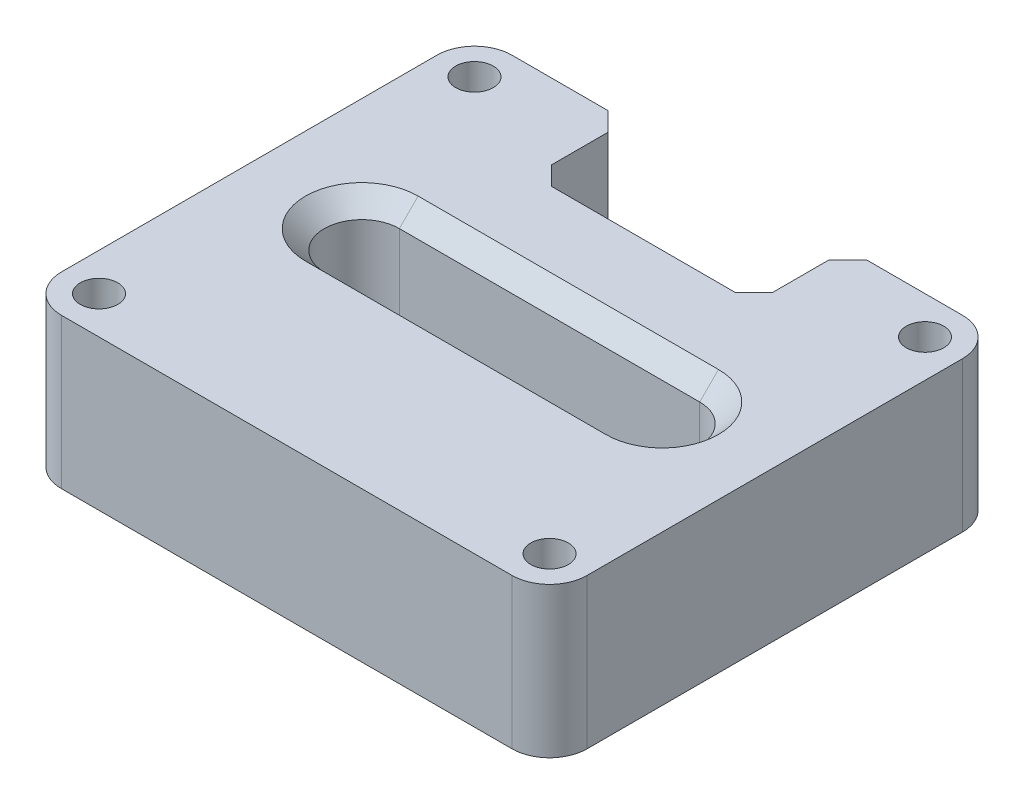
ISO-10303-21;
HEADER;
FILE_DESCRIPTION(('STEP AP214'),'2;1');
FILE_NAME('part.step','',(''),(''),'','','');
FILE_SCHEMA(('AUTOMOTIVE_DESIGN { 1 0 10303 214 1 1 1 1 }'));
ENDSEC;
DATA;
#1=APPLICATION_CONTEXT('core data for automotive mechanical design processes');
#2=APPLICATION_PROTOCOL_DEFINITION('international standard','automotive_design',2000,#1);
#3=PRODUCT_CONTEXT('',#1,'mechanical');
#4=PRODUCT('Part','Part','',(#3));
#5=PRODUCT_RELATED_PRODUCT_CATEGORY('part','',(#4));
#6=PRODUCT_DEFINITION_FORMATION('','',#4);
#7=PRODUCT_DEFINITION_CONTEXT('part definition',#1,'design');
#8=PRODUCT_DEFINITION('design','',#6,#7);
#9=PRODUCT_DEFINITION_SHAPE('','',#8);
#10=(LENGTH_UNIT() NAMED_UNIT(*) SI_UNIT(.MILLI.,.METRE.));
#11=(NAMED_UNIT(*) PLANE_ANGLE_UNIT() SI_UNIT($,.RADIAN.));
#12=(NAMED_UNIT(*) SI_UNIT($,.STERADIAN.) SOLID_ANGLE_UNIT());
#13=UNCERTAINTY_MEASURE_WITH_UNIT(LENGTH_MEASURE(1.E-05),#10,'distance_accuracy_value','');
#14=(GEOMETRIC_REPRESENTATION_CONTEXT(3) GLOBAL_UNCERTAINTY_ASSIGNED_CONTEXT((#13)) GLOBAL_UNIT_ASSIGNED_CONTEXT((#10,
#11,#12)) REPRESENTATION_CONTEXT('',''));
#15=CARTESIAN_POINT('',(0.,0.,0.));
#16=DIRECTION('',(0.,0.,1.));
#17=DIRECTION('',(1.,0.,0.));
#18=AXIS2_PLACEMENT_3D('',#15,#16,#17);
#19=CARTESIAN_POINT('',(-60.,40.,50.));
#20=DIRECTION('',(0.,1.,0.));
#21=DIRECTION('',(0.,0.,1.));
#22=AXIS2_PLACEMENT_3D('',#19,#20,#21);
#23=PLANE('',#22);
#24=DIRECTION('',(1.,0.,0.));
#25=VECTOR('',#24,1.);
#26=CARTESIAN_POINT('',(-60.,40.,-15.));
#27=LINE('',#26,#25);
#28=CARTESIAN_POINT('',(-40.,40.,-15.));
#29=VERTEX_POINT('',#28);
#30=CARTESIAN_POINT('',(40.,40.,-15.0000000000001));
#31=VERTEX_POINT('',#30);
#32=EDGE_CURVE('E258',#29,#31,#27,.T.);
#33=ORIENTED_EDGE('',*,*,#32,.T.);
#34=CARTESIAN_POINT('',(40.,40.,0.));
#35=DIRECTION('',(0.,1.,0.));
#36=DIRECTION('',(0.,0.,1.));
#37=AXIS2_PLACEMENT_3D('',#34,#35,#36);
#38=CIRCLE('',#37,15.);
#39=CARTESIAN_POINT('',(40.,40.,15.));
#40=VERTEX_POINT('',#39);
#41=EDGE_CURVE('E261',#31,#40,#38,.F.);
#42=ORIENTED_EDGE('',*,*,#41,.T.);
#43=DIRECTION('',(-1.,0.,0.));
#44=VECTOR('',#43,1.);
#45=CARTESIAN_POINT('',(-60.,40.,15.0000000000001));
#46=LINE('',#45,#44);
#47=CARTESIAN_POINT('',(-40.,40.,15.));
#48=VERTEX_POINT('',#47);
#49=EDGE_CURVE('E255',#40,#48,#46,.T.);
#50=ORIENTED_EDGE('',*,*,#49,.T.);
#51=CARTESIAN_POINT('',(-40.,40.,0.));
#52=DIRECTION('',(0.,1.,0.));
#53=DIRECTION('',(0.,0.,1.));
#54=AXIS2_PLACEMENT_3D('',#51,#52,#53);
#55=CIRCLE('',#54,15.);
#56=EDGE_CURVE('E252',#48,#29,#55,.F.);
#57=ORIENTED_EDGE('',*,*,#56,.T.);
#58=EDGE_LOOP('',(#33,#42,#50,#57));
#59=FACE_BOUND('',#58,.T.);
#60=CARTESIAN_POINT('',(60.,40.,50.));
#61=DIRECTION('',(0.,1.,0.));
#62=DIRECTION('',(0.,0.,1.));
#63=AXIS2_PLACEMENT_3D('',#60,#61,#62);
#64=CIRCLE('',#63,5.);
#65=CARTESIAN_POINT('',(60.,40.,55.));
#66=VERTEX_POINT('',#65);
#67=EDGE_CURVE('E880',#66,#66,#64,.T.);
#68=ORIENTED_EDGE('',*,*,#67,.F.);
#69=EDGE_LOOP('',(#68));
#70=FACE_BOUND('',#69,.T.);
#71=CARTESIAN_POINT('',(-60.,40.,-50.));
#72=DIRECTION('',(0.,1.,0.));
#73=DIRECTION('',(0.,0.,1.));
#74=AXIS2_PLACEMENT_3D('',#71,#72,#73);
#75=CIRCLE('',#74,5.);
#76=CARTESIAN_POINT('',(-60.,40.,-45.));
#77=VERTEX_POINT('',#76);
#78=EDGE_CURVE('E340',#77,#77,#75,.T.);
#79=ORIENTED_EDGE('',*,*,#78,.F.);
#80=EDGE_LOOP('',(#79));
#81=FACE_BOUND('',#80,.T.);
#82=CARTESIAN_POINT('',(-60.,40.,50.));
#83=DIRECTION('',(0.,1.,0.));
#84=DIRECTION('',(0.,0.,1.));
#85=AXIS2_PLACEMENT_3D('',#82,#83,#84);
#86=CIRCLE('',#85,9.99999999999999);
#87=CARTESIAN_POINT('',(-70.,40.,49.9999999999999));
#88=VERTEX_POINT('',#87);
#89=CARTESIAN_POINT('',(-59.9999999999999,40.,60.));
#90=VERTEX_POINT('',#89);
#91=EDGE_CURVE('E222',#88,#90,#86,.T.);
#92=ORIENTED_EDGE('',*,*,#91,.T.);
#93=DIRECTION('',(1.,0.,0.));
#94=VECTOR('',#93,1.);
#95=CARTESIAN_POINT('',(-59.9999999999999,40.,60.));
#96=LINE('',#95,#94);
#97=CARTESIAN_POINT('',(60.,40.,60.));
#98=VERTEX_POINT('',#97);
#99=EDGE_CURVE('E210',#90,#98,#96,.T.);
#100=ORIENTED_EDGE('',*,*,#99,.T.);
#101=CARTESIAN_POINT('',(60.,40.,50.));
#102=DIRECTION('',(0.,1.,0.));
#103=DIRECTION('',(0.,0.,1.));
#104=AXIS2_PLACEMENT_3D('',#101,#102,#103);
#105=CIRCLE('',#104,10.);
#106=CARTESIAN_POINT('',(70.,40.,49.9999999999999));
#107=VERTEX_POINT('',#106);
#108=EDGE_CURVE('E221',#98,#107,#105,.T.);
#109=ORIENTED_EDGE('',*,*,#108,.T.);
#110=DIRECTION('',(0.,0.,-1.));
#111=VECTOR('',#110,1.);
#112=CARTESIAN_POINT('',(70.,40.,-49.9999999999999));
#113=LINE('',#112,#111);
#114=CARTESIAN_POINT('',(70.,40.,-49.9999999999999));
#115=VERTEX_POINT('',#114);
#116=EDGE_CURVE('E358',#107,#115,#113,.T.);
#117=ORIENTED_EDGE('',*,*,#116,.T.);
#118=CARTESIAN_POINT('',(60.,40.,-50.));
#119=DIRECTION('',(0.,1.,0.));
#120=DIRECTION('',(0.,0.,-1.));
#121=AXIS2_PLACEMENT_3D('',#118,#119,#120);
#122=CIRCLE('',#121,10.);
#123=CARTESIAN_POINT('',(59.9999999999999,40.,-60.));
#124=VERTEX_POINT('',#123);
#125=EDGE_CURVE('E361',#115,#124,#122,.T.);
#126=ORIENTED_EDGE('',*,*,#125,.T.);
#127=DIRECTION('',(-1.,0.,0.));
#128=VECTOR('',#127,1.);
#129=CARTESIAN_POINT('',(34.435237910354,40.,-60.));
#130=LINE('',#129,#128);
#131=CARTESIAN_POINT('',(34.435237910354,40.,-60.));
#132=VERTEX_POINT('',#131);
#133=EDGE_CURVE('E364',#124,#132,#130,.T.);
#134=ORIENTED_EDGE('',*,*,#133,.T.);
#135=DIRECTION('',(-0.707106781186548,0.,0.707106781186547));
#136=VECTOR('',#135,1.);
#137=CARTESIAN_POINT('',(34.435237910354,40.,-60.));
#138=LINE('',#137,#136);
#139=CARTESIAN_POINT('',(29.435237910354,40.,-55.));
#140=VERTEX_POINT('',#139);
#141=EDGE_CURVE('E367',#132,#140,#138,.T.);
#142=ORIENTED_EDGE('',*,*,#141,.T.);
#143=DIRECTION('',(0.,0.,1.));
#144=VECTOR('',#143,1.);
#145=CARTESIAN_POINT('',(29.435237910354,40.,-55.));
#146=LINE('',#145,#144);
#147=CARTESIAN_POINT('',(29.435237910354,40.,-40.));
#148=VERTEX_POINT('',#147);
#149=EDGE_CURVE('E370',#140,#148,#146,.T.);
#150=ORIENTED_EDGE('',*,*,#149,.T.);
#151=DIRECTION('',(-0.707106781186548,0.,0.707106781186547));
#152=VECTOR('',#151,1.);
#153=CARTESIAN_POINT('',(24.435237910354,40.,-35.));
#154=LINE('',#153,#152);
#155=CARTESIAN_POINT('',(24.435237910354,40.,-35.));
#156=VERTEX_POINT('',#155);
#157=EDGE_CURVE('E373',#148,#156,#154,.T.);
#158=ORIENTED_EDGE('',*,*,#157,.T.);
#159=DIRECTION('',(-1.,0.,0.));
#160=VECTOR('',#159,1.);
#161=CARTESIAN_POINT('',(-24.435237910354,40.,-35.));
#162=LINE('',#161,#160);
#163=CARTESIAN_POINT('',(-24.435237910354,40.,-35.));
#164=VERTEX_POINT('',#163);
#165=EDGE_CURVE('E376',#156,#164,#162,.T.);
#166=ORIENTED_EDGE('',*,*,#165,.T.);
#167=DIRECTION('',(-0.707106781186548,0.,-0.707106781186547));
#168=VECTOR('',#167,1.);
#169=CARTESIAN_POINT('',(-29.435237910354,40.,-40.));
#170=LINE('',#169,#168);
#171=CARTESIAN_POINT('',(-29.435237910354,40.,-40.));
#172=VERTEX_POINT('',#171);
#173=EDGE_CURVE('E379',#164,#172,#170,.T.);
#174=ORIENTED_EDGE('',*,*,#173,.T.);
#175=DIRECTION('',(0.,0.,-1.));
#176=VECTOR('',#175,1.);
#177=CARTESIAN_POINT('',(-29.435237910354,40.,-55.));
#178=LINE('',#177,#176);
#179=CARTESIAN_POINT('',(-29.435237910354,40.,-55.));
#180=VERTEX_POINT('',#179);
#181=EDGE_CURVE('E382',#172,#180,#178,.T.);
#182=ORIENTED_EDGE('',*,*,#181,.T.);
#183=DIRECTION('',(-0.707106781186547,0.,-0.707106781186547));
#184=VECTOR('',#183,1.);
#185=CARTESIAN_POINT('',(-34.435237910354,40.,-60.));
#186=LINE('',#185,#184);
#187=CARTESIAN_POINT('',(-34.435237910354,40.,-60.));
#188=VERTEX_POINT('',#187);
#189=EDGE_CURVE('E385',#180,#188,#186,.T.);
#190=ORIENTED_EDGE('',*,*,#189,.T.);
#191=DIRECTION('',(-1.,0.,0.));
#192=VECTOR('',#191,1.);
#193=CARTESIAN_POINT('',(-59.9999999999999,40.,-60.));
#194=LINE('',#193,#192);
#195=CARTESIAN_POINT('',(-59.9999999999999,40.,-60.));
#196=VERTEX_POINT('',#195);
#197=EDGE_CURVE('E388',#188,#196,#194,.T.);
#198=ORIENTED_EDGE('',*,*,#197,.T.);
#199=CARTESIAN_POINT('',(-60.,40.,-50.));
#200=DIRECTION('',(0.,1.,0.));
#201=DIRECTION('',(0.,0.,1.));
#202=AXIS2_PLACEMENT_3D('',#199,#200,#201);
#203=CIRCLE('',#202,9.99999999999999);
#204=CARTESIAN_POINT('',(-70.,40.,-49.9999999999999));
#205=VERTEX_POINT('',#204);
#206=EDGE_CURVE('E391',#196,#205,#203,.T.);
#207=ORIENTED_EDGE('',*,*,#206,.T.);
#208=DIRECTION('',(0.,0.,1.));
#209=VECTOR('',#208,1.);
#210=CARTESIAN_POINT('',(-70.,40.,-49.9999999999999));
#211=LINE('',#210,#209);
#212=EDGE_CURVE('E227',#205,#88,#211,.T.);
#213=ORIENTED_EDGE('',*,*,#212,.T.);
#214=EDGE_LOOP('',(#92,#100,#109,#117,#126,#134,#142,#150,#158,#166,#174,#182,#190,#198,#207,#213));
#215=FACE_BOUND('',#214,.T.);
#216=CARTESIAN_POINT('',(60.,40.,-50.));
#217=DIRECTION('',(0.,1.,0.));
#218=DIRECTION('',(0.,0.,1.));
#219=AXIS2_PLACEMENT_3D('',#216,#217,#218);
#220=CIRCLE('',#219,5.00000000000001);
#221=CARTESIAN_POINT('',(60.,40.,-45.));
#222=VERTEX_POINT('',#221);
#223=EDGE_CURVE('E888',#222,#222,#220,.T.);
#224=ORIENTED_EDGE('',*,*,#223,.F.);
#225=EDGE_LOOP('',(#224));
#226=FACE_BOUND('',#225,.T.);
#227=CARTESIAN_POINT('',(-60.,40.,50.));
#228=DIRECTION('',(0.,1.,0.));
#229=DIRECTION('',(0.,0.,1.));
#230=AXIS2_PLACEMENT_3D('',#227,#228,#229);
#231=CIRCLE('',#230,5.);
#232=CARTESIAN_POINT('',(-60.,40.,55.));
#233=VERTEX_POINT('',#232);
#234=EDGE_CURVE('E870',#233,#233,#231,.T.);
#235=ORIENTED_EDGE('',*,*,#234,.F.);
#236=EDGE_LOOP('',(#235));
#237=FACE_BOUND('',#236,.T.);
#238=ADVANCED_FACE('F43',(#59,#70,#81,#215,#226,#237),#23,.T.);
#239=CARTESIAN_POINT('',(-60.,0.,50.));
#240=DIRECTION('',(0.,1.,0.));
#241=DIRECTION('',(0.,0.,1.));
#242=AXIS2_PLACEMENT_3D('',#239,#240,#241);
#243=PLANE('',#242);
#244=DIRECTION('',(1.,0.,0.));
#245=VECTOR('',#244,1.);
#246=CARTESIAN_POINT('',(40.,0.,15.));
#247=LINE('',#246,#245);
#248=CARTESIAN_POINT('',(-40.,0.,15.));
#249=VERTEX_POINT('',#248);
#250=CARTESIAN_POINT('',(40.,0.,15.));
#251=VERTEX_POINT('',#250);
#252=EDGE_CURVE('E69',#249,#251,#247,.T.);
#253=ORIENTED_EDGE('',*,*,#252,.T.);
#254=CARTESIAN_POINT('',(40.,0.,0.));
#255=DIRECTION('',(0.,1.,0.));
#256=DIRECTION('',(0.,0.,1.));
#257=AXIS2_PLACEMENT_3D('',#254,#255,#256);
#258=CIRCLE('',#257,15.);
#259=CARTESIAN_POINT('',(40.,0.,-15.));
#260=VERTEX_POINT('',#259);
#261=EDGE_CURVE('E11',#251,#260,#258,.T.);
#262=ORIENTED_EDGE('',*,*,#261,.T.);
#263=DIRECTION('',(-1.,0.,0.));
#264=VECTOR('',#263,1.);
#265=CARTESIAN_POINT('',(-40.,0.,-15.));
#266=LINE('',#265,#264);
#267=CARTESIAN_POINT('',(-40.,0.,-15.));
#268=VERTEX_POINT('',#267);
#269=EDGE_CURVE('E54',#260,#268,#266,.T.);
#270=ORIENTED_EDGE('',*,*,#269,.T.);
#271=CARTESIAN_POINT('',(-40.,0.,0.));
#272=DIRECTION('',(0.,1.,0.));
#273=DIRECTION('',(0.,0.,1.));
#274=AXIS2_PLACEMENT_3D('',#271,#272,#273);
#275=CIRCLE('',#274,15.);
#276=EDGE_CURVE('E283',#268,#249,#275,.T.);
#277=ORIENTED_EDGE('',*,*,#276,.T.);
#278=EDGE_LOOP('',(#253,#262,#270,#277));
#279=FACE_BOUND('',#278,.T.);
#280=CARTESIAN_POINT('',(-60.,0.,50.));
#281=DIRECTION('',(0.,1.,0.));
#282=DIRECTION('',(0.,0.,1.));
#283=AXIS2_PLACEMENT_3D('',#280,#281,#282);
#284=CIRCLE('',#283,9.99999999999999);
#285=CARTESIAN_POINT('',(-70.,0.,49.9999999999999));
#286=VERTEX_POINT('',#285);
#287=CARTESIAN_POINT('',(-59.9999999999999,0.,60.));
#288=VERTEX_POINT('',#287);
#289=EDGE_CURVE('E236',#286,#288,#284,.T.);
#290=ORIENTED_EDGE('',*,*,#289,.F.);
#291=DIRECTION('',(0.,0.,1.));
#292=VECTOR('',#291,1.);
#293=CARTESIAN_POINT('',(-70.,0.,-49.9999999999999));
#294=LINE('',#293,#292);
#295=CARTESIAN_POINT('',(-70.,0.,-49.9999999999999));
#296=VERTEX_POINT('',#295);
#297=EDGE_CURVE('E232',#296,#286,#294,.T.);
#298=ORIENTED_EDGE('',*,*,#297,.F.);
#299=CARTESIAN_POINT('',(-60.,0.,-50.));
#300=DIRECTION('',(0.,1.,0.));
#301=DIRECTION('',(0.,0.,1.));
#302=AXIS2_PLACEMENT_3D('',#299,#300,#301);
#303=CIRCLE('',#302,9.99999999999999);
#304=CARTESIAN_POINT('',(-59.9999999999999,0.,-60.));
#305=VERTEX_POINT('',#304);
#306=EDGE_CURVE('E438',#305,#296,#303,.T.);
#307=ORIENTED_EDGE('',*,*,#306,.F.);
#308=DIRECTION('',(-1.,0.,0.));
#309=VECTOR('',#308,1.);
#310=CARTESIAN_POINT('',(-59.9999999999999,0.,-60.));
#311=LINE('',#310,#309);
#312=CARTESIAN_POINT('',(-34.435237910354,0.,-60.));
#313=VERTEX_POINT('',#312);
#314=EDGE_CURVE('E435',#313,#305,#311,.T.);
#315=ORIENTED_EDGE('',*,*,#314,.F.);
#316=DIRECTION('',(-0.707106781186547,0.,-0.707106781186547));
#317=VECTOR('',#316,1.);
#318=CARTESIAN_POINT('',(-34.435237910354,0.,-60.));
#319=LINE('',#318,#317);
#320=CARTESIAN_POINT('',(-29.435237910354,0.,-55.));
#321=VERTEX_POINT('',#320);
#322=EDGE_CURVE('E432',#321,#313,#319,.T.);
#323=ORIENTED_EDGE('',*,*,#322,.F.);
#324=DIRECTION('',(0.,0.,-1.));
#325=VECTOR('',#324,1.);
#326=CARTESIAN_POINT('',(-29.435237910354,0.,-55.));
#327=LINE('',#326,#325);
#328=CARTESIAN_POINT('',(-29.435237910354,0.,-40.));
#329=VERTEX_POINT('',#328);
#330=EDGE_CURVE('E429',#329,#321,#327,.T.);
#331=ORIENTED_EDGE('',*,*,#330,.F.);
#332=DIRECTION('',(-0.707106781186548,0.,-0.707106781186547));
#333=VECTOR('',#332,1.);
#334=CARTESIAN_POINT('',(-29.435237910354,0.,-40.));
#335=LINE('',#334,#333);
#336=CARTESIAN_POINT('',(-24.435237910354,0.,-35.));
#337=VERTEX_POINT('',#336);
#338=EDGE_CURVE('E426',#337,#329,#335,.T.);
#339=ORIENTED_EDGE('',*,*,#338,.F.);
#340=DIRECTION('',(-1.,0.,0.));
#341=VECTOR('',#340,1.);
#342=CARTESIAN_POINT('',(-24.435237910354,0.,-35.));
#343=LINE('',#342,#341);
#344=CARTESIAN_POINT('',(24.435237910354,0.,-35.));
#345=VERTEX_POINT('',#344);
#346=EDGE_CURVE('E423',#345,#337,#343,.T.);
#347=ORIENTED_EDGE('',*,*,#346,.F.);
#348=DIRECTION('',(-0.707106781186548,0.,0.707106781186547));
#349=VECTOR('',#348,1.);
#350=CARTESIAN_POINT('',(24.435237910354,0.,-35.));
#351=LINE('',#350,#349);
#352=CARTESIAN_POINT('',(29.435237910354,0.,-40.));
#353=VERTEX_POINT('',#352);
#354=EDGE_CURVE('E420',#353,#345,#351,.T.);
#355=ORIENTED_EDGE('',*,*,#354,.F.);
#356=DIRECTION('',(0.,0.,1.));
#357=VECTOR('',#356,1.);
#358=CARTESIAN_POINT('',(29.435237910354,0.,-55.));
#359=LINE('',#358,#357);
#360=CARTESIAN_POINT('',(29.435237910354,0.,-55.));
#361=VERTEX_POINT('',#360);
#362=EDGE_CURVE('E417',#361,#353,#359,.T.);
#363=ORIENTED_EDGE('',*,*,#362,.F.);
#364=DIRECTION('',(-0.707106781186548,0.,0.707106781186547));
#365=VECTOR('',#364,1.);
#366=CARTESIAN_POINT('',(34.435237910354,0.,-60.));
#367=LINE('',#366,#365);
#368=CARTESIAN_POINT('',(34.435237910354,0.,-60.));
#369=VERTEX_POINT('',#368);
#370=EDGE_CURVE('E414',#369,#361,#367,.T.);
#371=ORIENTED_EDGE('',*,*,#370,.F.);
#372=DIRECTION('',(-1.,0.,0.));
#373=VECTOR('',#372,1.);
#374=CARTESIAN_POINT('',(34.435237910354,0.,-60.));
#375=LINE('',#374,#373);
#376=CARTESIAN_POINT('',(59.9999999999999,0.,-60.));
#377=VERTEX_POINT('',#376);
#378=EDGE_CURVE('E411',#377,#369,#375,.T.);
#379=ORIENTED_EDGE('',*,*,#378,.F.);
#380=CARTESIAN_POINT('',(60.,0.,-50.));
#381=DIRECTION('',(0.,1.,0.));
#382=DIRECTION('',(0.,0.,-1.));
#383=AXIS2_PLACEMENT_3D('',#380,#381,#382);
#384=CIRCLE('',#383,10.);
#385=CARTESIAN_POINT('',(70.,0.,-49.9999999999999));
#386=VERTEX_POINT('',#385);
#387=EDGE_CURVE('E408',#386,#377,#384,.T.);
#388=ORIENTED_EDGE('',*,*,#387,.F.);
#389=DIRECTION('',(0.,0.,-1.));
#390=VECTOR('',#389,1.);
#391=CARTESIAN_POINT('',(70.,0.,-49.9999999999999));
#392=LINE('',#391,#390);
#393=CARTESIAN_POINT('',(70.,0.,49.9999999999999));
#394=VERTEX_POINT('',#393);
#395=EDGE_CURVE('E405',#394,#386,#392,.T.);
#396=ORIENTED_EDGE('',*,*,#395,.F.);
#397=CARTESIAN_POINT('',(60.,0.,50.));
#398=DIRECTION('',(0.,1.,0.));
#399=DIRECTION('',(0.,0.,1.));
#400=AXIS2_PLACEMENT_3D('',#397,#398,#399);
#401=CIRCLE('',#400,10.);
#402=CARTESIAN_POINT('',(60.,0.,60.));
#403=VERTEX_POINT('',#402);
#404=EDGE_CURVE('E402',#403,#394,#401,.T.);
#405=ORIENTED_EDGE('',*,*,#404,.F.);
#406=DIRECTION('',(1.,0.,0.));
#407=VECTOR('',#406,1.);
#408=CARTESIAN_POINT('',(-59.9999999999999,0.,60.));
#409=LINE('',#408,#407);
#410=EDGE_CURVE('E399',#288,#403,#409,.T.);
#411=ORIENTED_EDGE('',*,*,#410,.F.);
#412=EDGE_LOOP('',(#290,#298,#307,#315,#323,#331,#339,#347,#355,#363,#371,#379,#388,#396,#405,#411));
#413=FACE_BOUND('',#412,.T.);
#414=CARTESIAN_POINT('',(-60.,0.,-50.));
#415=DIRECTION('',(0.,1.,0.));
#416=DIRECTION('',(0.,0.,1.));
#417=AXIS2_PLACEMENT_3D('',#414,#415,#416);
#418=CIRCLE('',#417,5.);
#419=CARTESIAN_POINT('',(-60.,0.,-45.));
#420=VERTEX_POINT('',#419);
#421=EDGE_CURVE('E347',#420,#420,#418,.T.);
#422=ORIENTED_EDGE('',*,*,#421,.T.);
#423=EDGE_LOOP('',(#422));
#424=FACE_BOUND('',#423,.T.);
#425=CARTESIAN_POINT('',(60.,0.,-50.));
#426=DIRECTION('',(0.,1.,0.));
#427=DIRECTION('',(0.,0.,1.));
#428=AXIS2_PLACEMENT_3D('',#425,#426,#427);
#429=CIRCLE('',#428,5.00000000000001);
#430=CARTESIAN_POINT('',(60.,0.,-45.));
#431=VERTEX_POINT('',#430);
#432=EDGE_CURVE('E884',#431,#431,#429,.T.);
#433=ORIENTED_EDGE('',*,*,#432,.T.);
#434=EDGE_LOOP('',(#433));
#435=FACE_BOUND('',#434,.T.);
#436=CARTESIAN_POINT('',(60.,0.,50.));
#437=DIRECTION('',(0.,1.,0.));
#438=DIRECTION('',(0.,0.,1.));
#439=AXIS2_PLACEMENT_3D('',#436,#437,#438);
#440=CIRCLE('',#439,5.);
#441=CARTESIAN_POINT('',(60.,0.,55.));
#442=VERTEX_POINT('',#441);
#443=EDGE_CURVE('E877',#442,#442,#440,.T.);
#444=ORIENTED_EDGE('',*,*,#443,.T.);
#445=EDGE_LOOP('',(#444));
#446=FACE_BOUND('',#445,.T.);
#447=CARTESIAN_POINT('',(-60.,0.,50.));
#448=DIRECTION('',(0.,1.,0.));
#449=DIRECTION('',(0.,0.,1.));
#450=AXIS2_PLACEMENT_3D('',#447,#448,#449);
#451=CIRCLE('',#450,5.);
#452=CARTESIAN_POINT('',(-60.,0.,55.));
#453=VERTEX_POINT('',#452);
#454=EDGE_CURVE('E304',#453,#453,#451,.T.);
#455=ORIENTED_EDGE('',*,*,#454,.T.);
#456=EDGE_LOOP('',(#455));
#457=FACE_BOUND('',#456,.T.);
#458=ADVANCED_FACE('F504',(#279,#413,#424,#435,#446,#457),#243,.F.);
#459=CARTESIAN_POINT('',(-60.,40.,50.));
#460=DIRECTION('',(0.,-1.,0.));
#461=DIRECTION('',(0.,0.,-1.));
#462=AXIS2_PLACEMENT_3D('',#459,#460,#461);
#463=CYLINDRICAL_SURFACE('',#462,9.99999999999999);
#464=ORIENTED_EDGE('',*,*,#289,.T.);
#465=DIRECTION('',(0.,-1.,0.));
#466=VECTOR('',#465,1.);
#467=CARTESIAN_POINT('',(-59.9999999999999,40.,60.));
#468=LINE('',#467,#466);
#469=EDGE_CURVE('E214',#90,#288,#468,.T.);
#470=ORIENTED_EDGE('',*,*,#469,.F.);
#471=ORIENTED_EDGE('',*,*,#91,.F.);
#472=DIRECTION('',(0.,-1.,0.));
#473=VECTOR('',#472,1.);
#474=CARTESIAN_POINT('',(-70.,40.,49.9999999999999));
#475=LINE('',#474,#473);
#476=EDGE_CURVE('E396',#88,#286,#475,.T.);
#477=ORIENTED_EDGE('',*,*,#476,.T.);
#478=EDGE_LOOP('',(#464,#470,#471,#477));
#479=FACE_BOUND('',#478,.T.);
#480=ADVANCED_FACE('F234',(#479),#463,.T.);
#481=CARTESIAN_POINT('',(-59.9999999999999,40.,60.));
#482=DIRECTION('',(0.,0.,-1.));
#483=DIRECTION('',(-1.,0.,0.));
#484=AXIS2_PLACEMENT_3D('',#481,#482,#483);
#485=PLANE('',#484);
#486=ORIENTED_EDGE('',*,*,#410,.T.);
#487=DIRECTION('',(0.,-1.,0.));
#488=VECTOR('',#487,1.);
#489=CARTESIAN_POINT('',(60.,40.,60.));
#490=LINE('',#489,#488);
#491=EDGE_CURVE('E217',#98,#403,#490,.T.);
#492=ORIENTED_EDGE('',*,*,#491,.F.);
#493=ORIENTED_EDGE('',*,*,#99,.F.);
#494=ORIENTED_EDGE('',*,*,#469,.T.);
#495=EDGE_LOOP('',(#486,#492,#493,#494));
#496=FACE_BOUND('',#495,.T.);
#497=ADVANCED_FACE('F212',(#496),#485,.F.);
#498=CARTESIAN_POINT('',(60.,40.,50.));
#499=DIRECTION('',(0.,-1.,0.));
#500=DIRECTION('',(0.,0.,-1.));
#501=AXIS2_PLACEMENT_3D('',#498,#499,#500);
#502=CYLINDRICAL_SURFACE('',#501,10.);
#503=ORIENTED_EDGE('',*,*,#404,.T.);
#504=DIRECTION('',(0.,-1.,0.));
#505=VECTOR('',#504,1.);
#506=CARTESIAN_POINT('',(70.,40.,49.9999999999999));
#507=LINE('',#506,#505);
#508=EDGE_CURVE('E245',#107,#394,#507,.T.);
#509=ORIENTED_EDGE('',*,*,#508,.F.);
#510=ORIENTED_EDGE('',*,*,#108,.F.);
#511=ORIENTED_EDGE('',*,*,#491,.T.);
#512=EDGE_LOOP('',(#503,#509,#510,#511));
#513=FACE_BOUND('',#512,.T.);
#514=ADVANCED_FACE('F518',(#513),#502,.T.);
#515=CARTESIAN_POINT('',(70.,40.,-49.9999999999999));
#516=DIRECTION('',(-1.,0.,0.));
#517=DIRECTION('',(0.,0.,1.));
#518=AXIS2_PLACEMENT_3D('',#515,#516,#517);
#519=PLANE('',#518);
#520=ORIENTED_EDGE('',*,*,#395,.T.);
#521=DIRECTION('',(0.,-1.,0.));
#522=VECTOR('',#521,1.);
#523=CARTESIAN_POINT('',(70.,40.,-49.9999999999999));
#524=LINE('',#523,#522);
#525=EDGE_CURVE('E489',#115,#386,#524,.T.);
#526=ORIENTED_EDGE('',*,*,#525,.F.);
#527=ORIENTED_EDGE('',*,*,#116,.F.);
#528=ORIENTED_EDGE('',*,*,#508,.T.);
#529=EDGE_LOOP('',(#520,#526,#527,#528));
#530=FACE_BOUND('',#529,.T.);
#531=ADVANCED_FACE('F498',(#530),#519,.F.);
#532=CARTESIAN_POINT('',(60.,40.,-50.));
#533=DIRECTION('',(0.,-1.,0.));
#534=DIRECTION('',(0.,0.,-1.));
#535=AXIS2_PLACEMENT_3D('',#532,#533,#534);
#536=CYLINDRICAL_SURFACE('',#535,10.);
#537=ORIENTED_EDGE('',*,*,#387,.T.);
#538=DIRECTION('',(0.,-1.,0.));
#539=VECTOR('',#538,1.);
#540=CARTESIAN_POINT('',(59.9999999999999,40.,-60.));
#541=LINE('',#540,#539);
#542=EDGE_CURVE('E485',#124,#377,#541,.T.);
#543=ORIENTED_EDGE('',*,*,#542,.F.);
#544=ORIENTED_EDGE('',*,*,#125,.F.);
#545=ORIENTED_EDGE('',*,*,#525,.T.);
#546=EDGE_LOOP('',(#537,#543,#544,#545));
#547=FACE_BOUND('',#546,.T.);
#548=ADVANCED_FACE('F510',(#547),#536,.T.);
#549=CARTESIAN_POINT('',(34.435237910354,40.,-60.));
#550=DIRECTION('',(0.,0.,1.));
#551=DIRECTION('',(1.,0.,0.));
#552=AXIS2_PLACEMENT_3D('',#549,#550,#551);
#553=PLANE('',#552);
#554=ORIENTED_EDGE('',*,*,#378,.T.);
#555=DIRECTION('',(0.,-1.,0.));
#556=VECTOR('',#555,1.);
#557=CARTESIAN_POINT('',(34.435237910354,40.,-60.));
#558=LINE('',#557,#556);
#559=EDGE_CURVE('E481',#132,#369,#558,.T.);
#560=ORIENTED_EDGE('',*,*,#559,.F.);
#561=ORIENTED_EDGE('',*,*,#133,.F.);
#562=ORIENTED_EDGE('',*,*,#542,.T.);
#563=EDGE_LOOP('',(#554,#560,#561,#562));
#564=FACE_BOUND('',#563,.T.);
#565=ADVANCED_FACE('F514',(#564),#553,.F.);
#566=CARTESIAN_POINT('',(34.435237910354,40.,-60.));
#567=DIRECTION('',(0.707106781186547,0.,0.707106781186548));
#568=DIRECTION('',(0.707106781186548,0.,-0.707106781186547));
#569=AXIS2_PLACEMENT_3D('',#566,#567,#568);
#570=PLANE('',#569);
#571=ORIENTED_EDGE('',*,*,#370,.T.);
#572=DIRECTION('',(0.,-1.,0.));
#573=VECTOR('',#572,1.);
#574=CARTESIAN_POINT('',(29.435237910354,40.,-55.));
#575=LINE('',#574,#573);
#576=EDGE_CURVE('E477',#140,#361,#575,.T.);
#577=ORIENTED_EDGE('',*,*,#576,.F.);
#578=ORIENTED_EDGE('',*,*,#141,.F.);
#579=ORIENTED_EDGE('',*,*,#559,.T.);
#580=EDGE_LOOP('',(#571,#577,#578,#579));
#581=FACE_BOUND('',#580,.T.);
#582=ADVANCED_FACE('F573',(#581),#570,.F.);
#583=CARTESIAN_POINT('',(29.435237910354,40.,-55.));
#584=DIRECTION('',(1.,0.,0.));
#585=DIRECTION('',(0.,0.,-1.));
#586=AXIS2_PLACEMENT_3D('',#583,#584,#585);
#587=PLANE('',#586);
#588=ORIENTED_EDGE('',*,*,#362,.T.);
#589=DIRECTION('',(0.,-1.,0.));
#590=VECTOR('',#589,1.);
#591=CARTESIAN_POINT('',(29.435237910354,40.,-40.));
#592=LINE('',#591,#590);
#593=EDGE_CURVE('E473',#148,#353,#592,.T.);
#594=ORIENTED_EDGE('',*,*,#593,.F.);
#595=ORIENTED_EDGE('',*,*,#149,.F.);
#596=ORIENTED_EDGE('',*,*,#576,.T.);
#597=EDGE_LOOP('',(#588,#594,#595,#596));
#598=FACE_BOUND('',#597,.T.);
#599=ADVANCED_FACE('F569',(#598),#587,.F.);
#600=CARTESIAN_POINT('',(24.435237910354,40.,-35.));
#601=DIRECTION('',(0.707106781186547,0.,0.707106781186548));
#602=DIRECTION('',(0.707106781186548,0.,-0.707106781186547));
#603=AXIS2_PLACEMENT_3D('',#600,#601,#602);
#604=PLANE('',#603);
#605=ORIENTED_EDGE('',*,*,#354,.T.);
#606=DIRECTION('',(0.,-1.,0.));
#607=VECTOR('',#606,1.);
#608=CARTESIAN_POINT('',(24.435237910354,40.,-35.));
#609=LINE('',#608,#607);
#610=EDGE_CURVE('E469',#156,#345,#609,.T.);
#611=ORIENTED_EDGE('',*,*,#610,.F.);
#612=ORIENTED_EDGE('',*,*,#157,.F.);
#613=ORIENTED_EDGE('',*,*,#593,.T.);
#614=EDGE_LOOP('',(#605,#611,#612,#613));
#615=FACE_BOUND('',#614,.T.);
#616=ADVANCED_FACE('F565',(#615),#604,.F.);
#617=CARTESIAN_POINT('',(-24.435237910354,40.,-35.));
#618=DIRECTION('',(0.,0.,1.));
#619=DIRECTION('',(1.,0.,0.));
#620=AXIS2_PLACEMENT_3D('',#617,#618,#619);
#621=PLANE('',#620);
#622=ORIENTED_EDGE('',*,*,#346,.T.);
#623=DIRECTION('',(0.,-1.,0.));
#624=VECTOR('',#623,1.);
#625=CARTESIAN_POINT('',(-24.435237910354,40.,-35.));
#626=LINE('',#625,#624);
#627=EDGE_CURVE('E465',#164,#337,#626,.T.);
#628=ORIENTED_EDGE('',*,*,#627,.F.);
#629=ORIENTED_EDGE('',*,*,#165,.F.);
#630=ORIENTED_EDGE('',*,*,#610,.T.);
#631=EDGE_LOOP('',(#622,#628,#629,#630));
#632=FACE_BOUND('',#631,.T.);
#633=ADVANCED_FACE('F561',(#632),#621,.F.);
#634=CARTESIAN_POINT('',(-29.435237910354,40.,-40.));
#635=DIRECTION('',(-0.707106781186547,0.,0.707106781186548));
#636=DIRECTION('',(0.707106781186548,0.,0.707106781186547));
#637=AXIS2_PLACEMENT_3D('',#634,#635,#636);
#638=PLANE('',#637);
#639=ORIENTED_EDGE('',*,*,#338,.T.);
#640=DIRECTION('',(0.,-1.,0.));
#641=VECTOR('',#640,1.);
#642=CARTESIAN_POINT('',(-29.435237910354,40.,-40.));
#643=LINE('',#642,#641);
#644=EDGE_CURVE('E461',#172,#329,#643,.T.);
#645=ORIENTED_EDGE('',*,*,#644,.F.);
#646=ORIENTED_EDGE('',*,*,#173,.F.);
#647=ORIENTED_EDGE('',*,*,#627,.T.);
#648=EDGE_LOOP('',(#639,#645,#646,#647));
#649=FACE_BOUND('',#648,.T.);
#650=ADVANCED_FACE('F557',(#649),#638,.F.);
#651=CARTESIAN_POINT('',(-29.435237910354,40.,-55.));
#652=DIRECTION('',(-1.,0.,0.));
#653=DIRECTION('',(0.,0.,1.));
#654=AXIS2_PLACEMENT_3D('',#651,#652,#653);
#655=PLANE('',#654);
#656=ORIENTED_EDGE('',*,*,#330,.T.);
#657=DIRECTION('',(0.,-1.,0.));
#658=VECTOR('',#657,1.);
#659=CARTESIAN_POINT('',(-29.435237910354,40.,-55.));
#660=LINE('',#659,#658);
#661=EDGE_CURVE('E457',#180,#321,#660,.T.);
#662=ORIENTED_EDGE('',*,*,#661,.F.);
#663=ORIENTED_EDGE('',*,*,#181,.F.);
#664=ORIENTED_EDGE('',*,*,#644,.T.);
#665=EDGE_LOOP('',(#656,#662,#663,#664));
#666=FACE_BOUND('',#665,.T.);
#667=ADVANCED_FACE('F553',(#666),#655,.F.);
#668=CARTESIAN_POINT('',(-34.435237910354,40.,-60.));
#669=DIRECTION('',(-0.707106781186548,0.,0.707106781186548));
#670=DIRECTION('',(0.707106781186548,0.,0.707106781186548));
#671=AXIS2_PLACEMENT_3D('',#668,#669,#670);
#672=PLANE('',#671);
#673=ORIENTED_EDGE('',*,*,#322,.T.);
#674=DIRECTION('',(0.,-1.,0.));
#675=VECTOR('',#674,1.);
#676=CARTESIAN_POINT('',(-34.435237910354,40.,-60.));
#677=LINE('',#676,#675);
#678=EDGE_CURVE('E453',#188,#313,#677,.T.);
#679=ORIENTED_EDGE('',*,*,#678,.F.);
#680=ORIENTED_EDGE('',*,*,#189,.F.);
#681=ORIENTED_EDGE('',*,*,#661,.T.);
#682=EDGE_LOOP('',(#673,#679,#680,#681));
#683=FACE_BOUND('',#682,.T.);
#684=ADVANCED_FACE('F549',(#683),#672,.F.);
#685=CARTESIAN_POINT('',(-59.9999999999999,40.,-60.));
#686=DIRECTION('',(0.,0.,1.));
#687=DIRECTION('',(1.,0.,0.));
#688=AXIS2_PLACEMENT_3D('',#685,#686,#687);
#689=PLANE('',#688);
#690=ORIENTED_EDGE('',*,*,#314,.T.);
#691=DIRECTION('',(0.,-1.,0.));
#692=VECTOR('',#691,1.);
#693=CARTESIAN_POINT('',(-59.9999999999999,40.,-60.));
#694=LINE('',#693,#692);
#695=EDGE_CURVE('E449',#196,#305,#694,.T.);
#696=ORIENTED_EDGE('',*,*,#695,.F.);
#697=ORIENTED_EDGE('',*,*,#197,.F.);
#698=ORIENTED_EDGE('',*,*,#678,.T.);
#699=EDGE_LOOP('',(#690,#696,#697,#698));
#700=FACE_BOUND('',#699,.T.);
#701=ADVANCED_FACE('F545',(#700),#689,.F.);
#702=CARTESIAN_POINT('',(-60.,40.,-50.));
#703=DIRECTION('',(0.,-1.,0.));
#704=DIRECTION('',(0.,0.,-1.));
#705=AXIS2_PLACEMENT_3D('',#702,#703,#704);
#706=CYLINDRICAL_SURFACE('',#705,9.99999999999999);
#707=ORIENTED_EDGE('',*,*,#306,.T.);
#708=DIRECTION('',(0.,-1.,0.));
#709=VECTOR('',#708,1.);
#710=CARTESIAN_POINT('',(-70.,40.,-49.9999999999999));
#711=LINE('',#710,#709);
#712=EDGE_CURVE('E445',#205,#296,#711,.T.);
#713=ORIENTED_EDGE('',*,*,#712,.F.);
#714=ORIENTED_EDGE('',*,*,#206,.F.);
#715=ORIENTED_EDGE('',*,*,#695,.T.);
#716=EDGE_LOOP('',(#707,#713,#714,#715));
#717=FACE_BOUND('',#716,.T.);
#718=ADVANCED_FACE('F541',(#717),#706,.T.);
#719=CARTESIAN_POINT('',(-70.,40.,-49.9999999999999));
#720=DIRECTION('',(1.,0.,0.));
#721=DIRECTION('',(0.,0.,-1.));
#722=AXIS2_PLACEMENT_3D('',#719,#720,#721);
#723=PLANE('',#722);
#724=ORIENTED_EDGE('',*,*,#297,.T.);
#725=ORIENTED_EDGE('',*,*,#476,.F.);
#726=ORIENTED_EDGE('',*,*,#212,.F.);
#727=ORIENTED_EDGE('',*,*,#712,.T.);
#728=EDGE_LOOP('',(#724,#725,#726,#727));
#729=FACE_BOUND('',#728,.T.);
#730=ADVANCED_FACE('F538',(#729),#723,.F.);
#731=CARTESIAN_POINT('',(-40.,40.,0.));
#732=DIRECTION('',(0.,-1.,0.));
#733=DIRECTION('',(0.,0.,-1.));
#734=AXIS2_PLACEMENT_3D('',#731,#732,#733);
#735=CYLINDRICAL_SURFACE('',#734,10.);
#736=DIRECTION('',(0.,-1.,0.));
#737=VECTOR('',#736,1.);
#738=CARTESIAN_POINT('',(-40.,40.,-10.));
#739=LINE('',#738,#737);
#740=CARTESIAN_POINT('',(-40.,35.,-10.));
#741=VERTEX_POINT('',#740);
#742=CARTESIAN_POINT('',(-40.,5.00000000000003,-10.));
#743=VERTEX_POINT('',#742);
#744=EDGE_CURVE('E329',#741,#743,#739,.T.);
#745=ORIENTED_EDGE('',*,*,#744,.F.);
#746=CARTESIAN_POINT('',(-40.,35.,0.));
#747=DIRECTION('',(0.,1.,0.));
#748=DIRECTION('',(0.,0.,1.));
#749=AXIS2_PLACEMENT_3D('',#746,#747,#748);
#750=CIRCLE('',#749,10.);
#751=CARTESIAN_POINT('',(-40.,35.,10.));
#752=VERTEX_POINT('',#751);
#753=EDGE_CURVE('E280',#741,#752,#750,.T.);
#754=ORIENTED_EDGE('',*,*,#753,.T.);
#755=DIRECTION('',(0.,-1.,0.));
#756=VECTOR('',#755,1.);
#757=CARTESIAN_POINT('',(-40.,40.,10.));
#758=LINE('',#757,#756);
#759=CARTESIAN_POINT('',(-40.,5.00000000000003,10.));
#760=VERTEX_POINT('',#759);
#761=EDGE_CURVE('E332',#752,#760,#758,.T.);
#762=ORIENTED_EDGE('',*,*,#761,.T.);
#763=CARTESIAN_POINT('',(-40.,5.00000000000003,0.));
#764=DIRECTION('',(0.,1.,0.));
#765=DIRECTION('',(0.,0.,1.));
#766=AXIS2_PLACEMENT_3D('',#763,#764,#765);
#767=CIRCLE('',#766,10.);
#768=EDGE_CURVE('E277',#760,#743,#767,.F.);
#769=ORIENTED_EDGE('',*,*,#768,.T.);
#770=EDGE_LOOP('',(#745,#754,#762,#769));
#771=FACE_BOUND('',#770,.T.);
#772=ADVANCED_FACE('F328',(#771),#735,.F.);
#773=CARTESIAN_POINT('',(-40.,40.,10.));
#774=DIRECTION('',(0.,0.,-1.));
#775=DIRECTION('',(-1.,0.,0.));
#776=AXIS2_PLACEMENT_3D('',#773,#774,#775);
#777=PLANE('',#776);
#778=ORIENTED_EDGE('',*,*,#761,.F.);
#779=DIRECTION('',(1.,0.,0.));
#780=VECTOR('',#779,1.);
#781=CARTESIAN_POINT('',(-40.,35.,10.));
#782=LINE('',#781,#780);
#783=CARTESIAN_POINT('',(40.,35.,10.));
#784=VERTEX_POINT('',#783);
#785=EDGE_CURVE('E274',#752,#784,#782,.T.);
#786=ORIENTED_EDGE('',*,*,#785,.T.);
#787=DIRECTION('',(0.,-1.,0.));
#788=VECTOR('',#787,1.);
#789=CARTESIAN_POINT('',(40.,40.,10.));
#790=LINE('',#789,#788);
#791=CARTESIAN_POINT('',(40.,5.00000000000003,10.));
#792=VERTEX_POINT('',#791);
#793=EDGE_CURVE('E344',#784,#792,#790,.T.);
#794=ORIENTED_EDGE('',*,*,#793,.T.);
#795=DIRECTION('',(-1.,0.,0.));
#796=VECTOR('',#795,1.);
#797=CARTESIAN_POINT('',(-40.,5.00000000000003,10.));
#798=LINE('',#797,#796);
#799=EDGE_CURVE('E271',#792,#760,#798,.T.);
#800=ORIENTED_EDGE('',*,*,#799,.T.);
#801=EDGE_LOOP('',(#778,#786,#794,#800));
#802=FACE_BOUND('',#801,.T.);
#803=ADVANCED_FACE('F636',(#802),#777,.T.);
#804=CARTESIAN_POINT('',(40.,40.,0.));
#805=DIRECTION('',(0.,-1.,0.));
#806=DIRECTION('',(0.,0.,-1.));
#807=AXIS2_PLACEMENT_3D('',#804,#805,#806);
#808=CYLINDRICAL_SURFACE('',#807,10.);
#809=ORIENTED_EDGE('',*,*,#793,.F.);
#810=CARTESIAN_POINT('',(40.,35.,0.));
#811=DIRECTION('',(0.,1.,0.));
#812=DIRECTION('',(0.,0.,1.));
#813=AXIS2_PLACEMENT_3D('',#810,#811,#812);
#814=CIRCLE('',#813,10.);
#815=CARTESIAN_POINT('',(40.,35.,-10.));
#816=VERTEX_POINT('',#815);
#817=EDGE_CURVE('E243',#784,#816,#814,.T.);
#818=ORIENTED_EDGE('',*,*,#817,.T.);
#819=DIRECTION('',(0.,-1.,0.));
#820=VECTOR('',#819,1.);
#821=CARTESIAN_POINT('',(40.,40.,-10.));
#822=LINE('',#821,#820);
#823=CARTESIAN_POINT('',(40.,5.00000000000003,-10.));
#824=VERTEX_POINT('',#823);
#825=EDGE_CURVE('E339',#816,#824,#822,.T.);
#826=ORIENTED_EDGE('',*,*,#825,.T.);
#827=CARTESIAN_POINT('',(40.,5.00000000000003,0.));
#828=DIRECTION('',(0.,1.,0.));
#829=DIRECTION('',(0.,0.,1.));
#830=AXIS2_PLACEMENT_3D('',#827,#828,#829);
#831=CIRCLE('',#830,10.);
#832=EDGE_CURVE('E238',#824,#792,#831,.F.);
#833=ORIENTED_EDGE('',*,*,#832,.T.);
#834=EDGE_LOOP('',(#809,#818,#826,#833));
#835=FACE_BOUND('',#834,.T.);
#836=ADVANCED_FACE('F643',(#835),#808,.F.);
#837=CARTESIAN_POINT('',(-40.,40.,-10.));
#838=DIRECTION('',(0.,0.,1.));
#839=DIRECTION('',(1.,0.,0.));
#840=AXIS2_PLACEMENT_3D('',#837,#838,#839);
#841=PLANE('',#840);
#842=ORIENTED_EDGE('',*,*,#825,.F.);
#843=DIRECTION('',(-1.,0.,0.));
#844=VECTOR('',#843,1.);
#845=CARTESIAN_POINT('',(-40.,35.,-10.));
#846=LINE('',#845,#844);
#847=EDGE_CURVE('E268',#816,#741,#846,.T.);
#848=ORIENTED_EDGE('',*,*,#847,.T.);
#849=ORIENTED_EDGE('',*,*,#744,.T.);
#850=DIRECTION('',(1.,0.,0.));
#851=VECTOR('',#850,1.);
#852=CARTESIAN_POINT('',(40.,5.00000000000003,-10.));
#853=LINE('',#852,#851);
#854=EDGE_CURVE('E265',#743,#824,#853,.T.);
#855=ORIENTED_EDGE('',*,*,#854,.T.);
#856=EDGE_LOOP('',(#842,#848,#849,#855));
#857=FACE_BOUND('',#856,.T.);
#858=ADVANCED_FACE('F335',(#857),#841,.T.);
#859=CARTESIAN_POINT('',(-60.,40.,-50.));
#860=DIRECTION('',(0.,-1.,0.));
#861=DIRECTION('',(0.,0.,-1.));
#862=AXIS2_PLACEMENT_3D('',#859,#860,#861);
#863=CYLINDRICAL_SURFACE('',#862,5.);
#864=ORIENTED_EDGE('',*,*,#78,.T.);
#865=EDGE_LOOP('',(#864));
#866=FACE_BOUND('',#865,.T.);
#867=ORIENTED_EDGE('',*,*,#421,.F.);
#868=EDGE_LOOP('',(#867));
#869=FACE_BOUND('',#868,.T.);
#870=ADVANCED_FACE('F657',(#866,#869),#863,.F.);
#871=CARTESIAN_POINT('',(60.,40.,-50.));
#872=DIRECTION('',(0.,-1.,0.));
#873=DIRECTION('',(0.,0.,-1.));
#874=AXIS2_PLACEMENT_3D('',#871,#872,#873);
#875=CYLINDRICAL_SURFACE('',#874,5.00000000000001);
#876=ORIENTED_EDGE('',*,*,#223,.T.);
#877=EDGE_LOOP('',(#876));
#878=FACE_BOUND('',#877,.T.);
#879=ORIENTED_EDGE('',*,*,#432,.F.);
#880=EDGE_LOOP('',(#879));
#881=FACE_BOUND('',#880,.T.);
#882=ADVANCED_FACE('F664',(#878,#881),#875,.F.);
#883=CARTESIAN_POINT('',(60.,40.,50.));
#884=DIRECTION('',(0.,-1.,0.));
#885=DIRECTION('',(0.,0.,-1.));
#886=AXIS2_PLACEMENT_3D('',#883,#884,#885);
#887=CYLINDRICAL_SURFACE('',#886,5.);
#888=ORIENTED_EDGE('',*,*,#67,.T.);
#889=EDGE_LOOP('',(#888));
#890=FACE_BOUND('',#889,.T.);
#891=ORIENTED_EDGE('',*,*,#443,.F.);
#892=EDGE_LOOP('',(#891));
#893=FACE_BOUND('',#892,.T.);
#894=ADVANCED_FACE('F672',(#890,#893),#887,.F.);
#895=CARTESIAN_POINT('',(-60.,40.,50.));
#896=DIRECTION('',(0.,-1.,0.));
#897=DIRECTION('',(0.,0.,-1.));
#898=AXIS2_PLACEMENT_3D('',#895,#896,#897);
#899=CYLINDRICAL_SURFACE('',#898,5.);
#900=ORIENTED_EDGE('',*,*,#234,.T.);
#901=EDGE_LOOP('',(#900));
#902=FACE_BOUND('',#901,.T.);
#903=ORIENTED_EDGE('',*,*,#454,.F.);
#904=EDGE_LOOP('',(#903));
#905=FACE_BOUND('',#904,.T.);
#906=ADVANCED_FACE('F680',(#902,#905),#899,.F.);
#907=CARTESIAN_POINT('',(-40.,35.,0.));
#908=DIRECTION('',(0.,1.,0.));
#909=DIRECTION('',(0.,0.,1.));
#910=AXIS2_PLACEMENT_3D('',#907,#908,#909);
#911=CONICAL_SURFACE('',#910,10.,0.785398163397449);
#912=DIRECTION('',(0.,-0.707106781186547,0.707106781186548));
#913=VECTOR('',#912,1.);
#914=CARTESIAN_POINT('',(-40.,40.,-15.));
#915=LINE('',#914,#913);
#916=EDGE_CURVE('E296',#29,#741,#915,.T.);
#917=ORIENTED_EDGE('',*,*,#916,.F.);
#918=ORIENTED_EDGE('',*,*,#56,.F.);
#919=DIRECTION('',(0.,0.707106781186547,0.707106781186548));
#920=VECTOR('',#919,1.);
#921=CARTESIAN_POINT('',(-40.,35.,10.));
#922=LINE('',#921,#920);
#923=EDGE_CURVE('E300',#752,#48,#922,.T.);
#924=ORIENTED_EDGE('',*,*,#923,.F.);
#925=ORIENTED_EDGE('',*,*,#753,.F.);
#926=EDGE_LOOP('',(#917,#918,#924,#925));
#927=FACE_BOUND('',#926,.T.);
#928=ADVANCED_FACE('F688',(#927),#911,.F.);
#929=CARTESIAN_POINT('',(-40.,35.,10.));
#930=DIRECTION('',(0.,-0.707106781186548,0.707106781186547));
#931=DIRECTION('',(1.,0.,0.));
#932=AXIS2_PLACEMENT_3D('',#929,#930,#931);
#933=PLANE('',#932);
#934=ORIENTED_EDGE('',*,*,#923,.T.);
#935=ORIENTED_EDGE('',*,*,#49,.F.);
#936=DIRECTION('',(0.,0.707106781186547,0.707106781186548));
#937=VECTOR('',#936,1.);
#938=CARTESIAN_POINT('',(40.,35.,10.));
#939=LINE('',#938,#937);
#940=EDGE_CURVE('E293',#784,#40,#939,.T.);
#941=ORIENTED_EDGE('',*,*,#940,.F.);
#942=ORIENTED_EDGE('',*,*,#785,.F.);
#943=EDGE_LOOP('',(#934,#935,#941,#942));
#944=FACE_BOUND('',#943,.T.);
#945=ADVANCED_FACE('F695',(#944),#933,.F.);
#946=CARTESIAN_POINT('',(-40.,35.,-10.));
#947=DIRECTION('',(0.,-0.707106781186548,-0.707106781186546));
#948=DIRECTION('',(-1.,0.,0.));
#949=AXIS2_PLACEMENT_3D('',#946,#947,#948);
#950=PLANE('',#949);
#951=ORIENTED_EDGE('',*,*,#916,.T.);
#952=ORIENTED_EDGE('',*,*,#847,.F.);
#953=DIRECTION('',(0.,-0.707106781186546,0.707106781186548));
#954=VECTOR('',#953,1.);
#955=CARTESIAN_POINT('',(40.,40.,-15.0000000000001));
#956=LINE('',#955,#954);
#957=EDGE_CURVE('E290',#31,#816,#956,.T.);
#958=ORIENTED_EDGE('',*,*,#957,.F.);
#959=ORIENTED_EDGE('',*,*,#32,.F.);
#960=EDGE_LOOP('',(#951,#952,#958,#959));
#961=FACE_BOUND('',#960,.T.);
#962=ADVANCED_FACE('F703',(#961),#950,.F.);
#963=CARTESIAN_POINT('',(40.,35.,0.));
#964=DIRECTION('',(0.,1.,0.));
#965=DIRECTION('',(0.,0.,1.));
#966=AXIS2_PLACEMENT_3D('',#963,#964,#965);
#967=CONICAL_SURFACE('',#966,10.,0.785398163397449);
#968=ORIENTED_EDGE('',*,*,#940,.T.);
#969=ORIENTED_EDGE('',*,*,#41,.F.);
#970=ORIENTED_EDGE('',*,*,#957,.T.);
#971=ORIENTED_EDGE('',*,*,#817,.F.);
#972=EDGE_LOOP('',(#968,#969,#970,#971));
#973=FACE_BOUND('',#972,.T.);
#974=ADVANCED_FACE('F711',(#973),#967,.F.);
#975=CARTESIAN_POINT('',(-40.,0.,0.));
#976=DIRECTION('',(0.,-1.,0.));
#977=DIRECTION('',(0.,0.,-1.));
#978=AXIS2_PLACEMENT_3D('',#975,#976,#977);
#979=CONICAL_SURFACE('',#978,15.,0.785398163397445);
#980=DIRECTION('',(0.,-0.70710678118655,-0.707106781186545));
#981=VECTOR('',#980,1.);
#982=CARTESIAN_POINT('',(-40.,5.00000000000003,-10.));
#983=LINE('',#982,#981);
#984=EDGE_CURVE('E309',#743,#268,#983,.T.);
#985=ORIENTED_EDGE('',*,*,#984,.F.);
#986=ORIENTED_EDGE('',*,*,#768,.F.);
#987=DIRECTION('',(0.,0.70710678118655,-0.707106781186545));
#988=VECTOR('',#987,1.);
#989=CARTESIAN_POINT('',(-40.,0.,15.));
#990=LINE('',#989,#988);
#991=EDGE_CURVE('E48',#249,#760,#990,.T.);
#992=ORIENTED_EDGE('',*,*,#991,.F.);
#993=ORIENTED_EDGE('',*,*,#276,.F.);
#994=EDGE_LOOP('',(#985,#986,#992,#993));
#995=FACE_BOUND('',#994,.T.);
#996=ADVANCED_FACE('F46',(#995),#979,.F.);
#997=CARTESIAN_POINT('',(-60.,0.,15.));
#998=DIRECTION('',(0.,-0.707106781186545,-0.70710678118655));
#999=DIRECTION('',(-1.,0.,0.));
#1000=AXIS2_PLACEMENT_3D('',#997,#998,#999);
#1001=PLANE('',#1000);
#1002=ORIENTED_EDGE('',*,*,#991,.T.);
#1003=ORIENTED_EDGE('',*,*,#799,.F.);
#1004=DIRECTION('',(0.,0.70710678118655,-0.707106781186545));
#1005=VECTOR('',#1004,1.);
#1006=CARTESIAN_POINT('',(40.,0.,15.));
#1007=LINE('',#1006,#1005);
#1008=EDGE_CURVE('E307',#251,#792,#1007,.T.);
#1009=ORIENTED_EDGE('',*,*,#1008,.F.);
#1010=ORIENTED_EDGE('',*,*,#252,.F.);
#1011=EDGE_LOOP('',(#1002,#1003,#1009,#1010));
#1012=FACE_BOUND('',#1011,.T.);
#1013=ADVANCED_FACE('F320',(#1012),#1001,.T.);
#1014=CARTESIAN_POINT('',(-60.,0.,-15.));
#1015=DIRECTION('',(0.,-0.707106781186546,0.707106781186549));
#1016=DIRECTION('',(1.,0.,0.));
#1017=AXIS2_PLACEMENT_3D('',#1014,#1015,#1016);
#1018=PLANE('',#1017);
#1019=ORIENTED_EDGE('',*,*,#984,.T.);
#1020=ORIENTED_EDGE('',*,*,#269,.F.);
#1021=DIRECTION('',(0.,-0.707106781186549,-0.707106781186546));
#1022=VECTOR('',#1021,1.);
#1023=CARTESIAN_POINT('',(40.,5.00000000000003,-10.));
#1024=LINE('',#1023,#1022);
#1025=EDGE_CURVE('E62',#824,#260,#1024,.T.);
#1026=ORIENTED_EDGE('',*,*,#1025,.F.);
#1027=ORIENTED_EDGE('',*,*,#854,.F.);
#1028=EDGE_LOOP('',(#1019,#1020,#1026,#1027));
#1029=FACE_BOUND('',#1028,.T.);
#1030=ADVANCED_FACE('F731',(#1029),#1018,.T.);
#1031=CARTESIAN_POINT('',(40.,0.,0.));
#1032=DIRECTION('',(0.,-1.,0.));
#1033=DIRECTION('',(0.,0.,-1.));
#1034=AXIS2_PLACEMENT_3D('',#1031,#1032,#1033);
#1035=CONICAL_SURFACE('',#1034,15.,0.785398163397445);
#1036=ORIENTED_EDGE('',*,*,#1008,.T.);
#1037=ORIENTED_EDGE('',*,*,#832,.F.);
#1038=ORIENTED_EDGE('',*,*,#1025,.T.);
#1039=ORIENTED_EDGE('',*,*,#261,.F.);
#1040=EDGE_LOOP('',(#1036,#1037,#1038,#1039));
#1041=FACE_BOUND('',#1040,.T.);
#1042=ADVANCED_FACE('F737',(#1041),#1035,.F.);
#1043=CLOSED_SHELL('',(#238,#458,#480,#497,#514,#531,#548,#565,#582,#599,#616,#633,#650,#667,
#684,#701,#718,#730,#772,#803,#836,#858,#870,#882,#894,#906,#928,#945,#962,#974,#996,#1013,
#1030,#1042));
#1044=MANIFOLD_SOLID_BREP('B2',#1043);
#1045=ADVANCED_BREP_SHAPE_REPRESENTATION('',(#18,#1044),#14);
#1046=SHAPE_DEFINITION_REPRESENTATION(#9,#1045);
ENDSEC;
END-ISO-10303-21;
